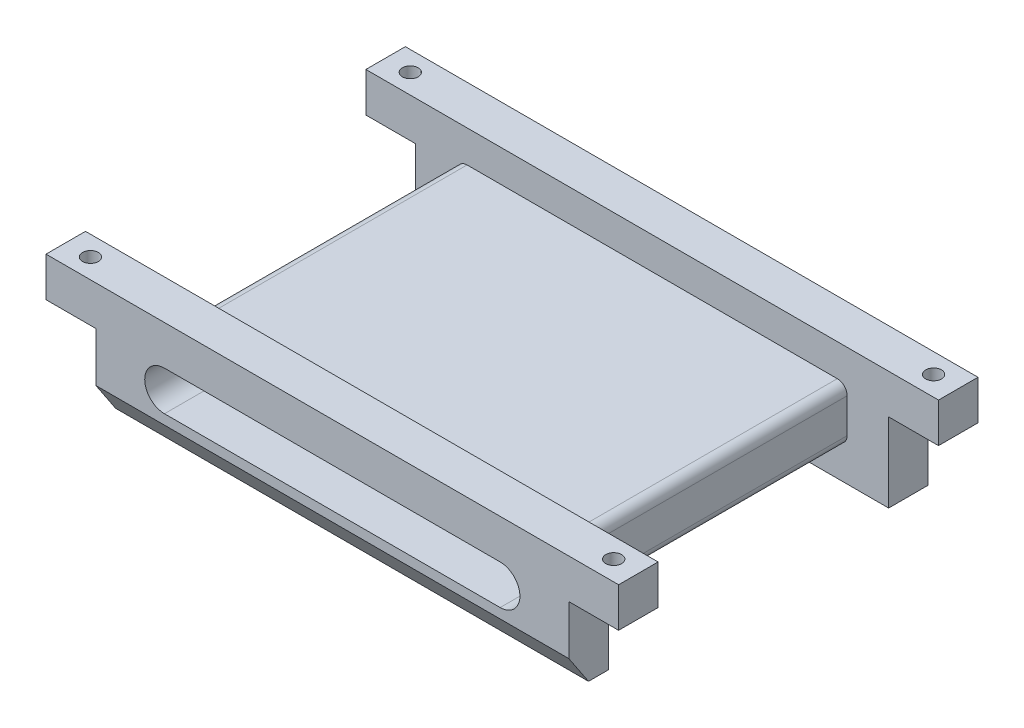
ISO-10303-21;
HEADER;
FILE_DESCRIPTION(('STEP AP214'),'2;1');
FILE_NAME('part.step','',(''),(''),'','','');
FILE_SCHEMA(('AUTOMOTIVE_DESIGN { 1 0 10303 214 1 1 1 1 }'));
ENDSEC;
DATA;
#1=APPLICATION_CONTEXT('core data for automotive mechanical design processes');
#2=APPLICATION_PROTOCOL_DEFINITION('international standard','automotive_design',2000,#1);
#3=PRODUCT_CONTEXT('',#1,'mechanical');
#4=PRODUCT('Part','Part','',(#3));
#5=PRODUCT_RELATED_PRODUCT_CATEGORY('part','',(#4));
#6=PRODUCT_DEFINITION_FORMATION('','',#4);
#7=PRODUCT_DEFINITION_CONTEXT('part definition',#1,'design');
#8=PRODUCT_DEFINITION('design','',#6,#7);
#9=PRODUCT_DEFINITION_SHAPE('','',#8);
#10=(LENGTH_UNIT() NAMED_UNIT(*) SI_UNIT(.MILLI.,.METRE.));
#11=(NAMED_UNIT(*) PLANE_ANGLE_UNIT() SI_UNIT($,.RADIAN.));
#12=(NAMED_UNIT(*) SI_UNIT($,.STERADIAN.) SOLID_ANGLE_UNIT());
#13=UNCERTAINTY_MEASURE_WITH_UNIT(LENGTH_MEASURE(1.E-05),#10,'distance_accuracy_value','');
#14=(GEOMETRIC_REPRESENTATION_CONTEXT(3) GLOBAL_UNCERTAINTY_ASSIGNED_CONTEXT((#13)) GLOBAL_UNIT_ASSIGNED_CONTEXT((#10,
#11,#12)) REPRESENTATION_CONTEXT('',''));
#15=CARTESIAN_POINT('',(0.,0.,0.));
#16=DIRECTION('',(0.,0.,1.));
#17=DIRECTION('',(1.,0.,0.));
#18=AXIS2_PLACEMENT_3D('',#15,#16,#17);
#19=CARTESIAN_POINT('',(0.,12.,36.4));
#20=DIRECTION('',(0.,-1.,0.));
#21=DIRECTION('',(0.,0.,-1.));
#22=AXIS2_PLACEMENT_3D('',#19,#20,#21);
#23=PLANE('',#22);
#24=CARTESIAN_POINT('',(2.5,12.,2.));
#25=DIRECTION('',(0.,1.,0.));
#26=DIRECTION('',(0.,0.,1.));
#27=AXIS2_PLACEMENT_3D('',#24,#25,#26);
#28=CIRCLE('',#27,0.799999999999988);
#29=CARTESIAN_POINT('',(2.5,12.,2.79999999999999));
#30=VERTEX_POINT('',#29);
#31=EDGE_CURVE('E837',#30,#30,#28,.T.);
#32=ORIENTED_EDGE('',*,*,#31,.F.);
#33=EDGE_LOOP('',(#32));
#34=FACE_BOUND('',#33,.T.);
#35=DIRECTION('',(0.,0.,-1.));
#36=VECTOR('',#35,1.);
#37=CARTESIAN_POINT('',(0.,12.,36.4));
#38=LINE('',#37,#36);
#39=CARTESIAN_POINT('',(0.,12.,4.));
#40=VERTEX_POINT('',#39);
#41=CARTESIAN_POINT('',(0.,12.,0.));
#42=VERTEX_POINT('',#41);
#43=EDGE_CURVE('E378',#40,#42,#38,.T.);
#44=ORIENTED_EDGE('',*,*,#43,.F.);
#45=DIRECTION('',(1.,0.,0.));
#46=VECTOR('',#45,1.);
#47=CARTESIAN_POINT('',(0.,12.,4.));
#48=LINE('',#47,#46);
#49=CARTESIAN_POINT('',(58.,12.,4.));
#50=VERTEX_POINT('',#49);
#51=EDGE_CURVE('E430',#40,#50,#48,.T.);
#52=ORIENTED_EDGE('',*,*,#51,.T.);
#53=DIRECTION('',(0.,0.,-1.));
#54=VECTOR('',#53,1.);
#55=CARTESIAN_POINT('',(58.,12.,36.4));
#56=LINE('',#55,#54);
#57=CARTESIAN_POINT('',(58.,12.,0.));
#58=VERTEX_POINT('',#57);
#59=EDGE_CURVE('E404',#50,#58,#56,.T.);
#60=ORIENTED_EDGE('',*,*,#59,.T.);
#61=DIRECTION('',(-1.,0.,0.));
#62=VECTOR('',#61,1.);
#63=CARTESIAN_POINT('',(0.,12.,0.));
#64=LINE('',#63,#62);
#65=EDGE_CURVE('E365',#58,#42,#64,.T.);
#66=ORIENTED_EDGE('',*,*,#65,.T.);
#67=EDGE_LOOP('',(#44,#52,#60,#66));
#68=FACE_BOUND('',#67,.T.);
#69=CARTESIAN_POINT('',(55.5,12.,2.));
#70=DIRECTION('',(0.,1.,0.));
#71=DIRECTION('',(0.,0.,1.));
#72=AXIS2_PLACEMENT_3D('',#69,#70,#71);
#73=CIRCLE('',#72,0.799999999999988);
#74=CARTESIAN_POINT('',(55.5,12.,2.79999999999999));
#75=VERTEX_POINT('',#74);
#76=EDGE_CURVE('E839',#75,#75,#73,.T.);
#77=ORIENTED_EDGE('',*,*,#76,.F.);
#78=EDGE_LOOP('',(#77));
#79=FACE_BOUND('',#78,.T.);
#80=ADVANCED_FACE('F35',(#34,#68,#79),#23,.F.);
#81=CARTESIAN_POINT('',(0.,8.,36.4));
#82=DIRECTION('',(1.,0.,0.));
#83=DIRECTION('',(0.,0.,-1.));
#84=AXIS2_PLACEMENT_3D('',#81,#82,#83);
#85=PLANE('',#84);
#86=CARTESIAN_POINT('',(0.,12.,36.4));
#87=VERTEX_POINT('',#86);
#88=CARTESIAN_POINT('',(0.,12.,32.4));
#89=VERTEX_POINT('',#88);
#90=EDGE_CURVE('E401',#87,#89,#38,.T.);
#91=ORIENTED_EDGE('',*,*,#90,.T.);
#92=DIRECTION('',(0.,-1.,0.));
#93=VECTOR('',#92,1.);
#94=CARTESIAN_POINT('',(0.,8.,32.4));
#95=LINE('',#94,#93);
#96=CARTESIAN_POINT('',(0.,8.,32.4));
#97=VERTEX_POINT('',#96);
#98=EDGE_CURVE('E326',#89,#97,#95,.T.);
#99=ORIENTED_EDGE('',*,*,#98,.T.);
#100=DIRECTION('',(0.,0.,-1.));
#101=VECTOR('',#100,1.);
#102=CARTESIAN_POINT('',(0.,8.,36.4));
#103=LINE('',#102,#101);
#104=CARTESIAN_POINT('',(0.,8.,36.4));
#105=VERTEX_POINT('',#104);
#106=EDGE_CURVE('E427',#105,#97,#103,.T.);
#107=ORIENTED_EDGE('',*,*,#106,.F.);
#108=DIRECTION('',(0.,-1.,0.));
#109=VECTOR('',#108,1.);
#110=CARTESIAN_POINT('',(0.,8.,36.4));
#111=LINE('',#110,#109);
#112=EDGE_CURVE('E361',#87,#105,#111,.T.);
#113=ORIENTED_EDGE('',*,*,#112,.F.);
#114=EDGE_LOOP('',(#91,#99,#107,#113));
#115=FACE_BOUND('',#114,.T.);
#116=ADVANCED_FACE('F464',(#115),#85,.F.);
#117=CARTESIAN_POINT('',(5.05,8.,36.4));
#118=DIRECTION('',(0.,1.,0.));
#119=DIRECTION('',(0.,0.,1.));
#120=AXIS2_PLACEMENT_3D('',#117,#118,#119);
#121=PLANE('',#120);
#122=CARTESIAN_POINT('',(2.5,8.,34.4));
#123=DIRECTION('',(0.,1.,0.));
#124=DIRECTION('',(0.,0.,1.));
#125=AXIS2_PLACEMENT_3D('',#122,#123,#124);
#126=CIRCLE('',#125,0.799999999999994);
#127=CARTESIAN_POINT('',(2.5,8.,35.2));
#128=VERTEX_POINT('',#127);
#129=EDGE_CURVE('E270',#128,#128,#126,.T.);
#130=ORIENTED_EDGE('',*,*,#129,.T.);
#131=EDGE_LOOP('',(#130));
#132=FACE_BOUND('',#131,.T.);
#133=ORIENTED_EDGE('',*,*,#106,.T.);
#134=DIRECTION('',(1.,0.,0.));
#135=VECTOR('',#134,1.);
#136=CARTESIAN_POINT('',(5.05,8.,32.4));
#137=LINE('',#136,#135);
#138=CARTESIAN_POINT('',(5.05,8.,32.4));
#139=VERTEX_POINT('',#138);
#140=EDGE_CURVE('E323',#97,#139,#137,.T.);
#141=ORIENTED_EDGE('',*,*,#140,.T.);
#142=DIRECTION('',(0.,0.,-1.));
#143=VECTOR('',#142,1.);
#144=CARTESIAN_POINT('',(5.05,8.,36.4));
#145=LINE('',#144,#143);
#146=CARTESIAN_POINT('',(5.05,8.,36.4));
#147=VERTEX_POINT('',#146);
#148=EDGE_CURVE('E423',#147,#139,#145,.T.);
#149=ORIENTED_EDGE('',*,*,#148,.F.);
#150=DIRECTION('',(1.,0.,0.));
#151=VECTOR('',#150,1.);
#152=CARTESIAN_POINT('',(5.05,8.,36.4));
#153=LINE('',#152,#151);
#154=EDGE_CURVE('E364',#105,#147,#153,.T.);
#155=ORIENTED_EDGE('',*,*,#154,.F.);
#156=EDGE_LOOP('',(#133,#141,#149,#155));
#157=FACE_BOUND('',#156,.T.);
#158=ADVANCED_FACE('F467',(#132,#157),#121,.F.);
#159=CARTESIAN_POINT('',(5.05,0.,36.4));
#160=DIRECTION('',(1.,0.,0.));
#161=DIRECTION('',(0.,1.,0.));
#162=AXIS2_PLACEMENT_3D('',#159,#160,#161);
#163=PLANE('',#162);
#164=DIRECTION('',(0.,0.,-1.));
#165=VECTOR('',#164,1.);
#166=CARTESIAN_POINT('',(5.05,0.,36.4));
#167=LINE('',#166,#165);
#168=CARTESIAN_POINT('',(5.05,0.,34.4));
#169=VERTEX_POINT('',#168);
#170=CARTESIAN_POINT('',(5.05,0.,32.4));
#171=VERTEX_POINT('',#170);
#172=EDGE_CURVE('E420',#169,#171,#167,.T.);
#173=ORIENTED_EDGE('',*,*,#172,.F.);
#174=DIRECTION('',(0.,-0.832050294337845,-0.554700196225228));
#175=VECTOR('',#174,1.);
#176=CARTESIAN_POINT('',(5.05,3.00000000000002,36.4));
#177=LINE('',#176,#175);
#178=CARTESIAN_POINT('',(5.05,3.00000000000002,36.4));
#179=VERTEX_POINT('',#178);
#180=EDGE_CURVE('E13',#169,#179,#177,.F.);
#181=ORIENTED_EDGE('',*,*,#180,.T.);
#182=DIRECTION('',(0.,-1.,0.));
#183=VECTOR('',#182,1.);
#184=CARTESIAN_POINT('',(5.05,0.,36.4));
#185=LINE('',#184,#183);
#186=EDGE_CURVE('E367',#147,#179,#185,.T.);
#187=ORIENTED_EDGE('',*,*,#186,.F.);
#188=ORIENTED_EDGE('',*,*,#148,.T.);
#189=DIRECTION('',(0.,-1.,0.));
#190=VECTOR('',#189,1.);
#191=CARTESIAN_POINT('',(5.05,0.,32.4));
#192=LINE('',#191,#190);
#193=EDGE_CURVE('E320',#139,#171,#192,.T.);
#194=ORIENTED_EDGE('',*,*,#193,.T.);
#195=EDGE_LOOP('',(#173,#181,#187,#188,#194));
#196=FACE_BOUND('',#195,.T.);
#197=ADVANCED_FACE('F469',(#196),#163,.F.);
#198=CARTESIAN_POINT('',(52.95,0.,36.4));
#199=DIRECTION('',(0.,1.,0.));
#200=DIRECTION('',(-1.,0.,0.));
#201=AXIS2_PLACEMENT_3D('',#198,#199,#200);
#202=PLANE('',#201);
#203=DIRECTION('',(0.,0.,-1.));
#204=VECTOR('',#203,1.);
#205=CARTESIAN_POINT('',(52.95,0.,36.4));
#206=LINE('',#205,#204);
#207=CARTESIAN_POINT('',(52.95,0.,34.4));
#208=VERTEX_POINT('',#207);
#209=CARTESIAN_POINT('',(52.95,0.,32.4));
#210=VERTEX_POINT('',#209);
#211=EDGE_CURVE('E417',#208,#210,#206,.T.);
#212=ORIENTED_EDGE('',*,*,#211,.F.);
#213=DIRECTION('',(-1.,0.,0.));
#214=VECTOR('',#213,1.);
#215=CARTESIAN_POINT('',(52.95,0.,34.4));
#216=LINE('',#215,#214);
#217=EDGE_CURVE('E43',#208,#169,#216,.T.);
#218=ORIENTED_EDGE('',*,*,#217,.T.);
#219=ORIENTED_EDGE('',*,*,#172,.T.);
#220=DIRECTION('',(1.,0.,0.));
#221=VECTOR('',#220,1.);
#222=CARTESIAN_POINT('',(52.95,0.,32.4));
#223=LINE('',#222,#221);
#224=EDGE_CURVE('E317',#171,#210,#223,.T.);
#225=ORIENTED_EDGE('',*,*,#224,.T.);
#226=EDGE_LOOP('',(#212,#218,#219,#225));
#227=FACE_BOUND('',#226,.T.);
#228=ADVANCED_FACE('F637',(#227),#202,.F.);
#229=CARTESIAN_POINT('',(52.95,8.,36.4));
#230=DIRECTION('',(-1.,0.,0.));
#231=DIRECTION('',(0.,0.,1.));
#232=AXIS2_PLACEMENT_3D('',#229,#230,#231);
#233=PLANE('',#232);
#234=DIRECTION('',(0.,1.,0.));
#235=VECTOR('',#234,1.);
#236=CARTESIAN_POINT('',(52.95,8.,36.4));
#237=LINE('',#236,#235);
#238=CARTESIAN_POINT('',(52.95,3.00000000000002,36.4));
#239=VERTEX_POINT('',#238);
#240=CARTESIAN_POINT('',(52.95,8.,36.4));
#241=VERTEX_POINT('',#240);
#242=EDGE_CURVE('E370',#239,#241,#237,.T.);
#243=ORIENTED_EDGE('',*,*,#242,.F.);
#244=DIRECTION('',(0.,0.832050294337845,0.554700196225228));
#245=VECTOR('',#244,1.);
#246=CARTESIAN_POINT('',(52.95,3.00000000000002,36.4));
#247=LINE('',#246,#245);
#248=EDGE_CURVE('E57',#239,#208,#247,.F.);
#249=ORIENTED_EDGE('',*,*,#248,.T.);
#250=ORIENTED_EDGE('',*,*,#211,.T.);
#251=DIRECTION('',(0.,1.,0.));
#252=VECTOR('',#251,1.);
#253=CARTESIAN_POINT('',(52.95,8.,32.4));
#254=LINE('',#253,#252);
#255=CARTESIAN_POINT('',(52.95,8.,32.4));
#256=VERTEX_POINT('',#255);
#257=EDGE_CURVE('E314',#210,#256,#254,.T.);
#258=ORIENTED_EDGE('',*,*,#257,.T.);
#259=DIRECTION('',(0.,0.,-1.));
#260=VECTOR('',#259,1.);
#261=CARTESIAN_POINT('',(52.95,8.,36.4));
#262=LINE('',#261,#260);
#263=EDGE_CURVE('E413',#241,#256,#262,.T.);
#264=ORIENTED_EDGE('',*,*,#263,.F.);
#265=EDGE_LOOP('',(#243,#249,#250,#258,#264));
#266=FACE_BOUND('',#265,.T.);
#267=ADVANCED_FACE('F447',(#266),#233,.F.);
#268=CARTESIAN_POINT('',(58.,8.,36.4));
#269=DIRECTION('',(0.,1.,0.));
#270=DIRECTION('',(0.,0.,1.));
#271=AXIS2_PLACEMENT_3D('',#268,#269,#270);
#272=PLANE('',#271);
#273=CARTESIAN_POINT('',(55.5,8.,34.4));
#274=DIRECTION('',(0.,1.,0.));
#275=DIRECTION('',(0.,0.,1.));
#276=AXIS2_PLACEMENT_3D('',#273,#274,#275);
#277=CIRCLE('',#276,0.799999999999995);
#278=CARTESIAN_POINT('',(55.5,8.,35.2));
#279=VERTEX_POINT('',#278);
#280=EDGE_CURVE('E509',#279,#279,#277,.T.);
#281=ORIENTED_EDGE('',*,*,#280,.T.);
#282=EDGE_LOOP('',(#281));
#283=FACE_BOUND('',#282,.T.);
#284=ORIENTED_EDGE('',*,*,#263,.T.);
#285=DIRECTION('',(1.,0.,0.));
#286=VECTOR('',#285,1.);
#287=CARTESIAN_POINT('',(58.,8.,32.4));
#288=LINE('',#287,#286);
#289=CARTESIAN_POINT('',(58.,8.,32.4));
#290=VERTEX_POINT('',#289);
#291=EDGE_CURVE('E311',#256,#290,#288,.T.);
#292=ORIENTED_EDGE('',*,*,#291,.T.);
#293=DIRECTION('',(0.,0.,-1.));
#294=VECTOR('',#293,1.);
#295=CARTESIAN_POINT('',(58.,8.,36.4));
#296=LINE('',#295,#294);
#297=CARTESIAN_POINT('',(58.,8.,36.4));
#298=VERTEX_POINT('',#297);
#299=EDGE_CURVE('E409',#298,#290,#296,.T.);
#300=ORIENTED_EDGE('',*,*,#299,.F.);
#301=DIRECTION('',(1.,0.,0.));
#302=VECTOR('',#301,1.);
#303=CARTESIAN_POINT('',(58.,8.,36.4));
#304=LINE('',#303,#302);
#305=EDGE_CURVE('E372',#241,#298,#304,.T.);
#306=ORIENTED_EDGE('',*,*,#305,.F.);
#307=EDGE_LOOP('',(#284,#292,#300,#306));
#308=FACE_BOUND('',#307,.T.);
#309=ADVANCED_FACE('F452',(#283,#308),#272,.F.);
#310=CARTESIAN_POINT('',(58.,12.,36.4));
#311=DIRECTION('',(-1.,0.,0.));
#312=DIRECTION('',(0.,0.,1.));
#313=AXIS2_PLACEMENT_3D('',#310,#311,#312);
#314=PLANE('',#313);
#315=ORIENTED_EDGE('',*,*,#299,.T.);
#316=DIRECTION('',(0.,1.,0.));
#317=VECTOR('',#316,1.);
#318=CARTESIAN_POINT('',(58.,12.,32.4));
#319=LINE('',#318,#317);
#320=CARTESIAN_POINT('',(58.,12.,32.4));
#321=VERTEX_POINT('',#320);
#322=EDGE_CURVE('E308',#290,#321,#319,.T.);
#323=ORIENTED_EDGE('',*,*,#322,.T.);
#324=CARTESIAN_POINT('',(58.,12.,36.4));
#325=VERTEX_POINT('',#324);
#326=EDGE_CURVE('E405',#325,#321,#56,.T.);
#327=ORIENTED_EDGE('',*,*,#326,.F.);
#328=DIRECTION('',(0.,1.,0.));
#329=VECTOR('',#328,1.);
#330=CARTESIAN_POINT('',(58.,12.,36.4));
#331=LINE('',#330,#329);
#332=EDGE_CURVE('E374',#298,#325,#331,.T.);
#333=ORIENTED_EDGE('',*,*,#332,.F.);
#334=EDGE_LOOP('',(#315,#323,#327,#333));
#335=FACE_BOUND('',#334,.T.);
#336=ADVANCED_FACE('F458',(#335),#314,.F.);
#337=CARTESIAN_POINT('',(55.5,12.,34.4));
#338=DIRECTION('',(0.,1.,0.));
#339=DIRECTION('',(0.,0.,1.));
#340=AXIS2_PLACEMENT_3D('',#337,#338,#339);
#341=CIRCLE('',#340,0.799999999999988);
#342=CARTESIAN_POINT('',(55.5,12.,35.2));
#343=VERTEX_POINT('',#342);
#344=EDGE_CURVE('E504',#343,#343,#341,.T.);
#345=ORIENTED_EDGE('',*,*,#344,.F.);
#346=EDGE_LOOP('',(#345));
#347=FACE_BOUND('',#346,.T.);
#348=CARTESIAN_POINT('',(2.5,12.,34.4));
#349=DIRECTION('',(0.,1.,0.));
#350=DIRECTION('',(0.,0.,1.));
#351=AXIS2_PLACEMENT_3D('',#348,#349,#350);
#352=CIRCLE('',#351,0.799999999999988);
#353=CARTESIAN_POINT('',(2.5,12.,35.2));
#354=VERTEX_POINT('',#353);
#355=EDGE_CURVE('E507',#354,#354,#352,.T.);
#356=ORIENTED_EDGE('',*,*,#355,.F.);
#357=EDGE_LOOP('',(#356));
#358=FACE_BOUND('',#357,.T.);
#359=ORIENTED_EDGE('',*,*,#326,.T.);
#360=DIRECTION('',(-1.,0.,0.));
#361=VECTOR('',#360,1.);
#362=CARTESIAN_POINT('',(0.,12.,32.4));
#363=LINE('',#362,#361);
#364=EDGE_CURVE('E433',#321,#89,#363,.T.);
#365=ORIENTED_EDGE('',*,*,#364,.T.);
#366=ORIENTED_EDGE('',*,*,#90,.F.);
#367=DIRECTION('',(-1.,0.,0.));
#368=VECTOR('',#367,1.);
#369=CARTESIAN_POINT('',(0.,12.,36.4));
#370=LINE('',#369,#368);
#371=EDGE_CURVE('E376',#325,#87,#370,.T.);
#372=ORIENTED_EDGE('',*,*,#371,.F.);
#373=EDGE_LOOP('',(#359,#365,#366,#372));
#374=FACE_BOUND('',#373,.T.);
#375=ADVANCED_FACE('F460',(#347,#358,#374),#23,.F.);
#376=CARTESIAN_POINT('',(0.,0.,36.4));
#377=DIRECTION('',(0.,0.,-1.));
#378=DIRECTION('',(-1.,0.,0.));
#379=AXIS2_PLACEMENT_3D('',#376,#377,#378);
#380=PLANE('',#379);
#381=ORIENTED_EDGE('',*,*,#186,.T.);
#382=DIRECTION('',(1.,0.,0.));
#383=VECTOR('',#382,1.);
#384=CARTESIAN_POINT('',(0.,3.00000000000002,36.4));
#385=LINE('',#384,#383);
#386=EDGE_CURVE('E436',#179,#239,#385,.T.);
#387=ORIENTED_EDGE('',*,*,#386,.T.);
#388=ORIENTED_EDGE('',*,*,#242,.T.);
#389=ORIENTED_EDGE('',*,*,#305,.T.);
#390=ORIENTED_EDGE('',*,*,#332,.T.);
#391=ORIENTED_EDGE('',*,*,#371,.T.);
#392=ORIENTED_EDGE('',*,*,#112,.T.);
#393=ORIENTED_EDGE('',*,*,#154,.T.);
#394=EDGE_LOOP('',(#381,#387,#388,#389,#390,#391,#392,#393));
#395=FACE_BOUND('',#394,.T.);
#396=CARTESIAN_POINT('',(12.,6.,36.4));
#397=DIRECTION('',(0.,0.,1.));
#398=DIRECTION('',(1.,0.,0.));
#399=AXIS2_PLACEMENT_3D('',#396,#397,#398);
#400=CIRCLE('',#399,2.);
#401=CARTESIAN_POINT('',(12.,8.,36.4));
#402=VERTEX_POINT('',#401);
#403=CARTESIAN_POINT('',(12.,4.,36.4));
#404=VERTEX_POINT('',#403);
#405=EDGE_CURVE('E330',#402,#404,#400,.T.);
#406=ORIENTED_EDGE('',*,*,#405,.F.);
#407=DIRECTION('',(-1.,0.,0.));
#408=VECTOR('',#407,1.);
#409=CARTESIAN_POINT('',(12.,8.,36.4));
#410=LINE('',#409,#408);
#411=CARTESIAN_POINT('',(46.,8.,36.4));
#412=VERTEX_POINT('',#411);
#413=EDGE_CURVE('E338',#412,#402,#410,.T.);
#414=ORIENTED_EDGE('',*,*,#413,.F.);
#415=CARTESIAN_POINT('',(46.,6.,36.4));
#416=DIRECTION('',(0.,0.,1.));
#417=DIRECTION('',(1.,0.,0.));
#418=AXIS2_PLACEMENT_3D('',#415,#416,#417);
#419=CIRCLE('',#418,2.);
#420=CARTESIAN_POINT('',(46.,4.,36.4));
#421=VERTEX_POINT('',#420);
#422=EDGE_CURVE('E335',#421,#412,#419,.T.);
#423=ORIENTED_EDGE('',*,*,#422,.F.);
#424=DIRECTION('',(1.,0.,0.));
#425=VECTOR('',#424,1.);
#426=CARTESIAN_POINT('',(12.,4.,36.4));
#427=LINE('',#426,#425);
#428=EDGE_CURVE('E332',#404,#421,#427,.T.);
#429=ORIENTED_EDGE('',*,*,#428,.F.);
#430=EDGE_LOOP('',(#406,#414,#423,#429));
#431=FACE_BOUND('',#430,.T.);
#432=ADVANCED_FACE('F441',(#395,#431),#380,.F.);
#433=CARTESIAN_POINT('',(0.,0.,0.));
#434=DIRECTION('',(0.,0.,-1.));
#435=DIRECTION('',(-1.,0.,0.));
#436=AXIS2_PLACEMENT_3D('',#433,#434,#435);
#437=PLANE('',#436);
#438=DIRECTION('',(0.,-1.,0.));
#439=VECTOR('',#438,1.);
#440=CARTESIAN_POINT('',(0.,8.,0.));
#441=LINE('',#440,#439);
#442=CARTESIAN_POINT('',(0.,8.,0.));
#443=VERTEX_POINT('',#442);
#444=EDGE_CURVE('E360',#42,#443,#441,.T.);
#445=ORIENTED_EDGE('',*,*,#444,.F.);
#446=ORIENTED_EDGE('',*,*,#65,.F.);
#447=DIRECTION('',(0.,1.,0.));
#448=VECTOR('',#447,1.);
#449=CARTESIAN_POINT('',(58.,12.,0.));
#450=LINE('',#449,#448);
#451=CARTESIAN_POINT('',(58.,8.,0.));
#452=VERTEX_POINT('',#451);
#453=EDGE_CURVE('E396',#452,#58,#450,.T.);
#454=ORIENTED_EDGE('',*,*,#453,.F.);
#455=DIRECTION('',(1.,0.,0.));
#456=VECTOR('',#455,1.);
#457=CARTESIAN_POINT('',(58.,8.,0.));
#458=LINE('',#457,#456);
#459=CARTESIAN_POINT('',(52.95,8.,0.));
#460=VERTEX_POINT('',#459);
#461=EDGE_CURVE('E393',#460,#452,#458,.T.);
#462=ORIENTED_EDGE('',*,*,#461,.F.);
#463=DIRECTION('',(0.,1.,0.));
#464=VECTOR('',#463,1.);
#465=CARTESIAN_POINT('',(52.95,8.,0.));
#466=LINE('',#465,#464);
#467=CARTESIAN_POINT('',(52.95,0.,0.));
#468=VERTEX_POINT('',#467);
#469=EDGE_CURVE('E390',#468,#460,#466,.T.);
#470=ORIENTED_EDGE('',*,*,#469,.F.);
#471=DIRECTION('',(1.,0.,0.));
#472=VECTOR('',#471,1.);
#473=CARTESIAN_POINT('',(52.95,0.,0.));
#474=LINE('',#473,#472);
#475=CARTESIAN_POINT('',(5.05,0.,0.));
#476=VERTEX_POINT('',#475);
#477=EDGE_CURVE('E387',#476,#468,#474,.T.);
#478=ORIENTED_EDGE('',*,*,#477,.F.);
#479=DIRECTION('',(0.,-1.,0.));
#480=VECTOR('',#479,1.);
#481=CARTESIAN_POINT('',(5.05,0.,0.));
#482=LINE('',#481,#480);
#483=CARTESIAN_POINT('',(5.05,8.,0.));
#484=VERTEX_POINT('',#483);
#485=EDGE_CURVE('E384',#484,#476,#482,.T.);
#486=ORIENTED_EDGE('',*,*,#485,.F.);
#487=DIRECTION('',(1.,0.,0.));
#488=VECTOR('',#487,1.);
#489=CARTESIAN_POINT('',(5.05,8.,0.));
#490=LINE('',#489,#488);
#491=EDGE_CURVE('E381',#443,#484,#490,.T.);
#492=ORIENTED_EDGE('',*,*,#491,.F.);
#493=EDGE_LOOP('',(#445,#446,#454,#462,#470,#478,#486,#492));
#494=FACE_BOUND('',#493,.T.);
#495=DIRECTION('',(-1.,0.,0.));
#496=VECTOR('',#495,1.);
#497=CARTESIAN_POINT('',(12.,8.,0.));
#498=LINE('',#497,#496);
#499=CARTESIAN_POINT('',(46.,8.,0.));
#500=VERTEX_POINT('',#499);
#501=CARTESIAN_POINT('',(12.,8.,0.));
#502=VERTEX_POINT('',#501);
#503=EDGE_CURVE('E333',#500,#502,#498,.T.);
#504=ORIENTED_EDGE('',*,*,#503,.T.);
#505=CARTESIAN_POINT('',(12.,6.,0.));
#506=DIRECTION('',(0.,0.,1.));
#507=DIRECTION('',(1.,0.,0.));
#508=AXIS2_PLACEMENT_3D('',#505,#506,#507);
#509=CIRCLE('',#508,2.);
#510=CARTESIAN_POINT('',(12.,4.,0.));
#511=VERTEX_POINT('',#510);
#512=EDGE_CURVE('E329',#502,#511,#509,.T.);
#513=ORIENTED_EDGE('',*,*,#512,.T.);
#514=DIRECTION('',(1.,0.,0.));
#515=VECTOR('',#514,1.);
#516=CARTESIAN_POINT('',(12.,4.,0.));
#517=LINE('',#516,#515);
#518=CARTESIAN_POINT('',(46.,4.,0.));
#519=VERTEX_POINT('',#518);
#520=EDGE_CURVE('E343',#511,#519,#517,.T.);
#521=ORIENTED_EDGE('',*,*,#520,.T.);
#522=CARTESIAN_POINT('',(46.,6.,0.));
#523=DIRECTION('',(0.,0.,1.));
#524=DIRECTION('',(1.,0.,0.));
#525=AXIS2_PLACEMENT_3D('',#522,#523,#524);
#526=CIRCLE('',#525,2.);
#527=EDGE_CURVE('E346',#519,#500,#526,.T.);
#528=ORIENTED_EDGE('',*,*,#527,.T.);
#529=EDGE_LOOP('',(#504,#513,#521,#528));
#530=FACE_BOUND('',#529,.T.);
#531=ADVANCED_FACE('F498',(#494,#530),#437,.T.);
#532=CARTESIAN_POINT('',(0.,8.,4.));
#533=VERTEX_POINT('',#532);
#534=EDGE_CURVE('E426',#533,#443,#103,.T.);
#535=ORIENTED_EDGE('',*,*,#534,.F.);
#536=DIRECTION('',(0.,1.,0.));
#537=VECTOR('',#536,1.);
#538=CARTESIAN_POINT('',(0.,8.,4.));
#539=LINE('',#538,#537);
#540=EDGE_CURVE('E305',#533,#40,#539,.T.);
#541=ORIENTED_EDGE('',*,*,#540,.T.);
#542=ORIENTED_EDGE('',*,*,#43,.T.);
#543=ORIENTED_EDGE('',*,*,#444,.T.);
#544=EDGE_LOOP('',(#535,#541,#542,#543));
#545=FACE_BOUND('',#544,.T.);
#546=ADVANCED_FACE('F487',(#545),#85,.F.);
#547=CARTESIAN_POINT('',(2.5,8.,2.));
#548=DIRECTION('',(0.,1.,0.));
#549=DIRECTION('',(0.,0.,1.));
#550=AXIS2_PLACEMENT_3D('',#547,#548,#549);
#551=CIRCLE('',#550,0.799999999999994);
#552=CARTESIAN_POINT('',(2.5,8.,2.8));
#553=VERTEX_POINT('',#552);
#554=EDGE_CURVE('E835',#553,#553,#551,.T.);
#555=ORIENTED_EDGE('',*,*,#554,.T.);
#556=EDGE_LOOP('',(#555));
#557=FACE_BOUND('',#556,.T.);
#558=CARTESIAN_POINT('',(5.05,8.,4.));
#559=VERTEX_POINT('',#558);
#560=EDGE_CURVE('E422',#559,#484,#145,.T.);
#561=ORIENTED_EDGE('',*,*,#560,.F.);
#562=DIRECTION('',(-1.,0.,0.));
#563=VECTOR('',#562,1.);
#564=CARTESIAN_POINT('',(5.05,8.,4.));
#565=LINE('',#564,#563);
#566=EDGE_CURVE('E302',#559,#533,#565,.T.);
#567=ORIENTED_EDGE('',*,*,#566,.T.);
#568=ORIENTED_EDGE('',*,*,#534,.T.);
#569=ORIENTED_EDGE('',*,*,#491,.T.);
#570=EDGE_LOOP('',(#561,#567,#568,#569));
#571=FACE_BOUND('',#570,.T.);
#572=ADVANCED_FACE('F585',(#557,#571),#121,.F.);
#573=CARTESIAN_POINT('',(5.05,0.,4.));
#574=VERTEX_POINT('',#573);
#575=EDGE_CURVE('E419',#574,#476,#167,.T.);
#576=ORIENTED_EDGE('',*,*,#575,.F.);
#577=DIRECTION('',(0.,1.,0.));
#578=VECTOR('',#577,1.);
#579=CARTESIAN_POINT('',(5.05,0.,4.));
#580=LINE('',#579,#578);
#581=EDGE_CURVE('E299',#574,#559,#580,.T.);
#582=ORIENTED_EDGE('',*,*,#581,.T.);
#583=ORIENTED_EDGE('',*,*,#560,.T.);
#584=ORIENTED_EDGE('',*,*,#485,.T.);
#585=EDGE_LOOP('',(#576,#582,#583,#584));
#586=FACE_BOUND('',#585,.T.);
#587=ADVANCED_FACE('F621',(#586),#163,.F.);
#588=CARTESIAN_POINT('',(52.95,0.,4.));
#589=VERTEX_POINT('',#588);
#590=EDGE_CURVE('E416',#589,#468,#206,.T.);
#591=ORIENTED_EDGE('',*,*,#590,.F.);
#592=DIRECTION('',(-1.,0.,0.));
#593=VECTOR('',#592,1.);
#594=CARTESIAN_POINT('',(52.95,0.,4.));
#595=LINE('',#594,#593);
#596=EDGE_CURVE('E296',#589,#574,#595,.T.);
#597=ORIENTED_EDGE('',*,*,#596,.T.);
#598=ORIENTED_EDGE('',*,*,#575,.T.);
#599=ORIENTED_EDGE('',*,*,#477,.T.);
#600=EDGE_LOOP('',(#591,#597,#598,#599));
#601=FACE_BOUND('',#600,.T.);
#602=ADVANCED_FACE('F618',(#601),#202,.F.);
#603=CARTESIAN_POINT('',(52.95,8.,4.));
#604=VERTEX_POINT('',#603);
#605=EDGE_CURVE('E412',#604,#460,#262,.T.);
#606=ORIENTED_EDGE('',*,*,#605,.F.);
#607=DIRECTION('',(0.,-1.,0.));
#608=VECTOR('',#607,1.);
#609=CARTESIAN_POINT('',(52.95,8.,4.));
#610=LINE('',#609,#608);
#611=EDGE_CURVE('E293',#604,#589,#610,.T.);
#612=ORIENTED_EDGE('',*,*,#611,.T.);
#613=ORIENTED_EDGE('',*,*,#590,.T.);
#614=ORIENTED_EDGE('',*,*,#469,.T.);
#615=EDGE_LOOP('',(#606,#612,#613,#614));
#616=FACE_BOUND('',#615,.T.);
#617=ADVANCED_FACE('F615',(#616),#233,.F.);
#618=CARTESIAN_POINT('',(55.5,8.,2.));
#619=DIRECTION('',(0.,1.,0.));
#620=DIRECTION('',(0.,0.,1.));
#621=AXIS2_PLACEMENT_3D('',#618,#619,#620);
#622=CIRCLE('',#621,0.799999999999995);
#623=CARTESIAN_POINT('',(55.5,8.,2.8));
#624=VERTEX_POINT('',#623);
#625=EDGE_CURVE('E844',#624,#624,#622,.T.);
#626=ORIENTED_EDGE('',*,*,#625,.T.);
#627=EDGE_LOOP('',(#626));
#628=FACE_BOUND('',#627,.T.);
#629=CARTESIAN_POINT('',(58.,8.,4.));
#630=VERTEX_POINT('',#629);
#631=EDGE_CURVE('E408',#630,#452,#296,.T.);
#632=ORIENTED_EDGE('',*,*,#631,.F.);
#633=DIRECTION('',(-1.,0.,0.));
#634=VECTOR('',#633,1.);
#635=CARTESIAN_POINT('',(58.,8.,4.));
#636=LINE('',#635,#634);
#637=EDGE_CURVE('E290',#630,#604,#636,.T.);
#638=ORIENTED_EDGE('',*,*,#637,.T.);
#639=ORIENTED_EDGE('',*,*,#605,.T.);
#640=ORIENTED_EDGE('',*,*,#461,.T.);
#641=EDGE_LOOP('',(#632,#638,#639,#640));
#642=FACE_BOUND('',#641,.T.);
#643=ADVANCED_FACE('F612',(#628,#642),#272,.F.);
#644=ORIENTED_EDGE('',*,*,#59,.F.);
#645=DIRECTION('',(0.,-1.,0.));
#646=VECTOR('',#645,1.);
#647=CARTESIAN_POINT('',(58.,12.,4.));
#648=LINE('',#647,#646);
#649=EDGE_CURVE('E258',#50,#630,#648,.T.);
#650=ORIENTED_EDGE('',*,*,#649,.T.);
#651=ORIENTED_EDGE('',*,*,#631,.T.);
#652=ORIENTED_EDGE('',*,*,#453,.T.);
#653=EDGE_LOOP('',(#644,#650,#651,#652));
#654=FACE_BOUND('',#653,.T.);
#655=ADVANCED_FACE('F500',(#654),#314,.F.);
#656=CARTESIAN_POINT('',(12.,6.,36.4));
#657=DIRECTION('',(0.,0.,-1.));
#658=DIRECTION('',(-1.,0.,0.));
#659=AXIS2_PLACEMENT_3D('',#656,#657,#658);
#660=CYLINDRICAL_SURFACE('',#659,2.);
#661=ORIENTED_EDGE('',*,*,#512,.F.);
#662=DIRECTION('',(0.,0.,-1.));
#663=VECTOR('',#662,1.);
#664=CARTESIAN_POINT('',(12.,8.,36.4));
#665=LINE('',#664,#663);
#666=EDGE_CURVE('E340',#402,#502,#665,.T.);
#667=ORIENTED_EDGE('',*,*,#666,.F.);
#668=ORIENTED_EDGE('',*,*,#405,.T.);
#669=DIRECTION('',(0.,0.,-1.));
#670=VECTOR('',#669,1.);
#671=CARTESIAN_POINT('',(12.,4.,36.4));
#672=LINE('',#671,#670);
#673=EDGE_CURVE('E357',#404,#511,#672,.T.);
#674=ORIENTED_EDGE('',*,*,#673,.T.);
#675=EDGE_LOOP('',(#661,#667,#668,#674));
#676=FACE_BOUND('',#675,.T.);
#677=ADVANCED_FACE('F576',(#676),#660,.F.);
#678=CARTESIAN_POINT('',(12.,4.,36.4));
#679=DIRECTION('',(0.,1.,0.));
#680=DIRECTION('',(0.,0.,1.));
#681=AXIS2_PLACEMENT_3D('',#678,#679,#680);
#682=PLANE('',#681);
#683=ORIENTED_EDGE('',*,*,#520,.F.);
#684=ORIENTED_EDGE('',*,*,#673,.F.);
#685=ORIENTED_EDGE('',*,*,#428,.T.);
#686=DIRECTION('',(0.,0.,-1.));
#687=VECTOR('',#686,1.);
#688=CARTESIAN_POINT('',(46.,4.,36.4));
#689=LINE('',#688,#687);
#690=EDGE_CURVE('E355',#421,#519,#689,.T.);
#691=ORIENTED_EDGE('',*,*,#690,.T.);
#692=EDGE_LOOP('',(#683,#684,#685,#691));
#693=FACE_BOUND('',#692,.T.);
#694=ADVANCED_FACE('F572',(#693),#682,.T.);
#695=CARTESIAN_POINT('',(46.,6.,36.4));
#696=DIRECTION('',(0.,0.,-1.));
#697=DIRECTION('',(-1.,0.,0.));
#698=AXIS2_PLACEMENT_3D('',#695,#696,#697);
#699=CYLINDRICAL_SURFACE('',#698,2.);
#700=ORIENTED_EDGE('',*,*,#527,.F.);
#701=ORIENTED_EDGE('',*,*,#690,.F.);
#702=ORIENTED_EDGE('',*,*,#422,.T.);
#703=DIRECTION('',(0.,0.,-1.));
#704=VECTOR('',#703,1.);
#705=CARTESIAN_POINT('',(46.,8.,36.4));
#706=LINE('',#705,#704);
#707=EDGE_CURVE('E353',#412,#500,#706,.T.);
#708=ORIENTED_EDGE('',*,*,#707,.T.);
#709=EDGE_LOOP('',(#700,#701,#702,#708));
#710=FACE_BOUND('',#709,.T.);
#711=ADVANCED_FACE('F568',(#710),#699,.F.);
#712=CARTESIAN_POINT('',(12.,8.,36.4));
#713=DIRECTION('',(0.,-1.,0.));
#714=DIRECTION('',(0.,0.,-1.));
#715=AXIS2_PLACEMENT_3D('',#712,#713,#714);
#716=PLANE('',#715);
#717=ORIENTED_EDGE('',*,*,#503,.F.);
#718=ORIENTED_EDGE('',*,*,#707,.F.);
#719=ORIENTED_EDGE('',*,*,#413,.T.);
#720=ORIENTED_EDGE('',*,*,#666,.T.);
#721=EDGE_LOOP('',(#717,#718,#719,#720));
#722=FACE_BOUND('',#721,.T.);
#723=ADVANCED_FACE('F565',(#722),#716,.T.);
#724=CARTESIAN_POINT('',(29.,6.,32.4));
#725=DIRECTION('',(0.,0.,1.));
#726=DIRECTION('',(1.,0.,0.));
#727=AXIS2_PLACEMENT_3D('',#724,#725,#726);
#728=PLANE('',#727);
#729=CARTESIAN_POINT('',(10.25,4.25,32.4));
#730=DIRECTION('',(0.,0.,1.));
#731=DIRECTION('',(1.,0.,0.));
#732=AXIS2_PLACEMENT_3D('',#729,#730,#731);
#733=CIRCLE('',#732,1.);
#734=CARTESIAN_POINT('',(9.25,4.25,32.4));
#735=VERTEX_POINT('',#734);
#736=CARTESIAN_POINT('',(10.25,3.25,32.4));
#737=VERTEX_POINT('',#736);
#738=EDGE_CURVE('E252',#735,#737,#733,.T.);
#739=ORIENTED_EDGE('',*,*,#738,.T.);
#740=DIRECTION('',(1.,0.,0.));
#741=VECTOR('',#740,1.);
#742=CARTESIAN_POINT('',(10.25,3.25,32.4));
#743=LINE('',#742,#741);
#744=CARTESIAN_POINT('',(47.75,3.25,32.4));
#745=VERTEX_POINT('',#744);
#746=EDGE_CURVE('E229',#737,#745,#743,.T.);
#747=ORIENTED_EDGE('',*,*,#746,.T.);
#748=CARTESIAN_POINT('',(47.75,4.25,32.4));
#749=DIRECTION('',(0.,0.,1.));
#750=DIRECTION('',(1.,0.,0.));
#751=AXIS2_PLACEMENT_3D('',#748,#749,#750);
#752=CIRCLE('',#751,1.);
#753=CARTESIAN_POINT('',(48.75,4.25,32.4));
#754=VERTEX_POINT('',#753);
#755=EDGE_CURVE('E234',#745,#754,#752,.T.);
#756=ORIENTED_EDGE('',*,*,#755,.T.);
#757=DIRECTION('',(0.,1.,0.));
#758=VECTOR('',#757,1.);
#759=CARTESIAN_POINT('',(48.75,7.75,32.4));
#760=LINE('',#759,#758);
#761=CARTESIAN_POINT('',(48.75,7.75,32.4));
#762=VERTEX_POINT('',#761);
#763=EDGE_CURVE('E285',#754,#762,#760,.T.);
#764=ORIENTED_EDGE('',*,*,#763,.T.);
#765=CARTESIAN_POINT('',(47.75,7.75,32.4));
#766=DIRECTION('',(0.,0.,1.));
#767=DIRECTION('',(-1.,0.,0.));
#768=AXIS2_PLACEMENT_3D('',#765,#766,#767);
#769=CIRCLE('',#768,1.);
#770=CARTESIAN_POINT('',(47.75,8.75,32.4));
#771=VERTEX_POINT('',#770);
#772=EDGE_CURVE('E282',#762,#771,#769,.T.);
#773=ORIENTED_EDGE('',*,*,#772,.T.);
#774=DIRECTION('',(-1.,0.,0.));
#775=VECTOR('',#774,1.);
#776=CARTESIAN_POINT('',(10.25,8.75,32.4));
#777=LINE('',#776,#775);
#778=CARTESIAN_POINT('',(10.25,8.75,32.4));
#779=VERTEX_POINT('',#778);
#780=EDGE_CURVE('E279',#771,#779,#777,.T.);
#781=ORIENTED_EDGE('',*,*,#780,.T.);
#782=CARTESIAN_POINT('',(10.25,7.75,32.4));
#783=DIRECTION('',(0.,0.,1.));
#784=DIRECTION('',(1.,0.,0.));
#785=AXIS2_PLACEMENT_3D('',#782,#783,#784);
#786=CIRCLE('',#785,1.);
#787=CARTESIAN_POINT('',(9.25,7.75,32.4));
#788=VERTEX_POINT('',#787);
#789=EDGE_CURVE('E276',#779,#788,#786,.T.);
#790=ORIENTED_EDGE('',*,*,#789,.T.);
#791=DIRECTION('',(0.,-1.,0.));
#792=VECTOR('',#791,1.);
#793=CARTESIAN_POINT('',(9.25,7.75,32.4));
#794=LINE('',#793,#792);
#795=EDGE_CURVE('E273',#788,#735,#794,.T.);
#796=ORIENTED_EDGE('',*,*,#795,.T.);
#797=EDGE_LOOP('',(#739,#747,#756,#764,#773,#781,#790,#796));
#798=FACE_BOUND('',#797,.T.);
#799=ORIENTED_EDGE('',*,*,#364,.F.);
#800=ORIENTED_EDGE('',*,*,#322,.F.);
#801=ORIENTED_EDGE('',*,*,#291,.F.);
#802=ORIENTED_EDGE('',*,*,#257,.F.);
#803=ORIENTED_EDGE('',*,*,#224,.F.);
#804=ORIENTED_EDGE('',*,*,#193,.F.);
#805=ORIENTED_EDGE('',*,*,#140,.F.);
#806=ORIENTED_EDGE('',*,*,#98,.F.);
#807=EDGE_LOOP('',(#799,#800,#801,#802,#803,#804,#805,#806));
#808=FACE_BOUND('',#807,.T.);
#809=ADVANCED_FACE('F530',(#798,#808),#728,.F.);
#810=CARTESIAN_POINT('',(0.,0.,4.));
#811=DIRECTION('',(0.,0.,-1.));
#812=DIRECTION('',(-1.,0.,0.));
#813=AXIS2_PLACEMENT_3D('',#810,#811,#812);
#814=PLANE('',#813);
#815=DIRECTION('',(0.,-1.,0.));
#816=VECTOR('',#815,1.);
#817=CARTESIAN_POINT('',(9.25,7.75,4.));
#818=LINE('',#817,#816);
#819=CARTESIAN_POINT('',(9.25,7.75,4.));
#820=VERTEX_POINT('',#819);
#821=CARTESIAN_POINT('',(9.25,4.25,4.));
#822=VERTEX_POINT('',#821);
#823=EDGE_CURVE('E248',#820,#822,#818,.T.);
#824=ORIENTED_EDGE('',*,*,#823,.F.);
#825=CARTESIAN_POINT('',(10.25,7.75,4.));
#826=DIRECTION('',(0.,0.,-1.));
#827=DIRECTION('',(-1.,0.,0.));
#828=AXIS2_PLACEMENT_3D('',#825,#826,#827);
#829=CIRCLE('',#828,1.);
#830=CARTESIAN_POINT('',(10.25,8.75,4.));
#831=VERTEX_POINT('',#830);
#832=EDGE_CURVE('E255',#831,#820,#829,.F.);
#833=ORIENTED_EDGE('',*,*,#832,.F.);
#834=DIRECTION('',(-1.,0.,0.));
#835=VECTOR('',#834,1.);
#836=CARTESIAN_POINT('',(10.25,8.75,4.));
#837=LINE('',#836,#835);
#838=CARTESIAN_POINT('',(47.75,8.75,4.));
#839=VERTEX_POINT('',#838);
#840=EDGE_CURVE('E259',#839,#831,#837,.T.);
#841=ORIENTED_EDGE('',*,*,#840,.F.);
#842=CARTESIAN_POINT('',(47.75,7.75,4.));
#843=DIRECTION('',(0.,0.,-1.));
#844=DIRECTION('',(-1.,0.,0.));
#845=AXIS2_PLACEMENT_3D('',#842,#843,#844);
#846=CIRCLE('',#845,1.);
#847=CARTESIAN_POINT('',(48.75,7.75,4.));
#848=VERTEX_POINT('',#847);
#849=EDGE_CURVE('E262',#848,#839,#846,.F.);
#850=ORIENTED_EDGE('',*,*,#849,.F.);
#851=DIRECTION('',(0.,1.,0.));
#852=VECTOR('',#851,1.);
#853=CARTESIAN_POINT('',(48.75,7.75,4.));
#854=LINE('',#853,#852);
#855=CARTESIAN_POINT('',(48.75,4.25,4.));
#856=VERTEX_POINT('',#855);
#857=EDGE_CURVE('E265',#856,#848,#854,.T.);
#858=ORIENTED_EDGE('',*,*,#857,.F.);
#859=CARTESIAN_POINT('',(47.75,4.25,4.));
#860=DIRECTION('',(0.,0.,-1.));
#861=DIRECTION('',(-1.,0.,0.));
#862=AXIS2_PLACEMENT_3D('',#859,#860,#861);
#863=CIRCLE('',#862,1.);
#864=CARTESIAN_POINT('',(47.75,3.25,4.));
#865=VERTEX_POINT('',#864);
#866=EDGE_CURVE('E243',#865,#856,#863,.F.);
#867=ORIENTED_EDGE('',*,*,#866,.F.);
#868=DIRECTION('',(1.,0.,0.));
#869=VECTOR('',#868,1.);
#870=CARTESIAN_POINT('',(10.25,3.25,4.));
#871=LINE('',#870,#869);
#872=CARTESIAN_POINT('',(10.25,3.25,4.));
#873=VERTEX_POINT('',#872);
#874=EDGE_CURVE('E227',#873,#865,#871,.T.);
#875=ORIENTED_EDGE('',*,*,#874,.F.);
#876=CARTESIAN_POINT('',(10.25,4.25,4.));
#877=DIRECTION('',(0.,0.,-1.));
#878=DIRECTION('',(-1.,0.,0.));
#879=AXIS2_PLACEMENT_3D('',#876,#877,#878);
#880=CIRCLE('',#879,1.);
#881=EDGE_CURVE('E240',#822,#873,#880,.F.);
#882=ORIENTED_EDGE('',*,*,#881,.F.);
#883=EDGE_LOOP('',(#824,#833,#841,#850,#858,#867,#875,#882));
#884=FACE_BOUND('',#883,.T.);
#885=ORIENTED_EDGE('',*,*,#566,.F.);
#886=ORIENTED_EDGE('',*,*,#581,.F.);
#887=ORIENTED_EDGE('',*,*,#596,.F.);
#888=ORIENTED_EDGE('',*,*,#611,.F.);
#889=ORIENTED_EDGE('',*,*,#637,.F.);
#890=ORIENTED_EDGE('',*,*,#649,.F.);
#891=ORIENTED_EDGE('',*,*,#51,.F.);
#892=ORIENTED_EDGE('',*,*,#540,.F.);
#893=EDGE_LOOP('',(#885,#886,#887,#888,#889,#890,#891,#892));
#894=FACE_BOUND('',#893,.T.);
#895=ADVANCED_FACE('F238',(#884,#894),#814,.F.);
#896=CARTESIAN_POINT('',(10.25,4.25,-61.3456034968262));
#897=DIRECTION('',(0.,0.,1.));
#898=DIRECTION('',(1.,0.,0.));
#899=AXIS2_PLACEMENT_3D('',#896,#897,#898);
#900=CYLINDRICAL_SURFACE('',#899,1.);
#901=ORIENTED_EDGE('',*,*,#881,.T.);
#902=DIRECTION('',(0.,0.,1.));
#903=VECTOR('',#902,1.);
#904=CARTESIAN_POINT('',(10.25,3.25,-61.3456034968262));
#905=LINE('',#904,#903);
#906=EDGE_CURVE('E224',#873,#737,#905,.T.);
#907=ORIENTED_EDGE('',*,*,#906,.T.);
#908=ORIENTED_EDGE('',*,*,#738,.F.);
#909=DIRECTION('',(0.,0.,1.));
#910=VECTOR('',#909,1.);
#911=CARTESIAN_POINT('',(9.25,4.25,-61.3456034968262));
#912=LINE('',#911,#910);
#913=EDGE_CURVE('E246',#822,#735,#912,.T.);
#914=ORIENTED_EDGE('',*,*,#913,.F.);
#915=EDGE_LOOP('',(#901,#907,#908,#914));
#916=FACE_BOUND('',#915,.T.);
#917=ADVANCED_FACE('F245',(#916),#900,.T.);
#918=CARTESIAN_POINT('',(9.25,7.75,-61.3456034968262));
#919=DIRECTION('',(-1.,0.,0.));
#920=DIRECTION('',(0.,-1.,0.));
#921=AXIS2_PLACEMENT_3D('',#918,#919,#920);
#922=PLANE('',#921);
#923=ORIENTED_EDGE('',*,*,#823,.T.);
#924=ORIENTED_EDGE('',*,*,#913,.T.);
#925=ORIENTED_EDGE('',*,*,#795,.F.);
#926=DIRECTION('',(0.,0.,1.));
#927=VECTOR('',#926,1.);
#928=CARTESIAN_POINT('',(9.25,7.75,-61.3456034968262));
#929=LINE('',#928,#927);
#930=EDGE_CURVE('E271',#820,#788,#929,.T.);
#931=ORIENTED_EDGE('',*,*,#930,.F.);
#932=EDGE_LOOP('',(#923,#924,#925,#931));
#933=FACE_BOUND('',#932,.T.);
#934=ADVANCED_FACE('F552',(#933),#922,.T.);
#935=CARTESIAN_POINT('',(10.25,7.75,-61.3456034968262));
#936=DIRECTION('',(0.,0.,1.));
#937=DIRECTION('',(1.,0.,0.));
#938=AXIS2_PLACEMENT_3D('',#935,#936,#937);
#939=CYLINDRICAL_SURFACE('',#938,1.);
#940=ORIENTED_EDGE('',*,*,#832,.T.);
#941=ORIENTED_EDGE('',*,*,#930,.T.);
#942=ORIENTED_EDGE('',*,*,#789,.F.);
#943=DIRECTION('',(0.,0.,1.));
#944=VECTOR('',#943,1.);
#945=CARTESIAN_POINT('',(10.25,8.75,-61.3456034968262));
#946=LINE('',#945,#944);
#947=EDGE_CURVE('E274',#831,#779,#946,.T.);
#948=ORIENTED_EDGE('',*,*,#947,.F.);
#949=EDGE_LOOP('',(#940,#941,#942,#948));
#950=FACE_BOUND('',#949,.T.);
#951=ADVANCED_FACE('F549',(#950),#939,.T.);
#952=CARTESIAN_POINT('',(10.25,8.75,-61.3456034968262));
#953=DIRECTION('',(0.,1.,0.));
#954=DIRECTION('',(0.,0.,1.));
#955=AXIS2_PLACEMENT_3D('',#952,#953,#954);
#956=PLANE('',#955);
#957=ORIENTED_EDGE('',*,*,#840,.T.);
#958=ORIENTED_EDGE('',*,*,#947,.T.);
#959=ORIENTED_EDGE('',*,*,#780,.F.);
#960=DIRECTION('',(0.,0.,1.));
#961=VECTOR('',#960,1.);
#962=CARTESIAN_POINT('',(47.75,8.75,-61.3456034968262));
#963=LINE('',#962,#961);
#964=EDGE_CURVE('E277',#839,#771,#963,.T.);
#965=ORIENTED_EDGE('',*,*,#964,.F.);
#966=EDGE_LOOP('',(#957,#958,#959,#965));
#967=FACE_BOUND('',#966,.T.);
#968=ADVANCED_FACE('F544',(#967),#956,.T.);
#969=CARTESIAN_POINT('',(47.75,7.75,-61.3456034968262));
#970=DIRECTION('',(0.,0.,1.));
#971=DIRECTION('',(1.,0.,0.));
#972=AXIS2_PLACEMENT_3D('',#969,#970,#971);
#973=CYLINDRICAL_SURFACE('',#972,1.);
#974=ORIENTED_EDGE('',*,*,#849,.T.);
#975=ORIENTED_EDGE('',*,*,#964,.T.);
#976=ORIENTED_EDGE('',*,*,#772,.F.);
#977=DIRECTION('',(0.,0.,1.));
#978=VECTOR('',#977,1.);
#979=CARTESIAN_POINT('',(48.75,7.75,-61.3456034968262));
#980=LINE('',#979,#978);
#981=EDGE_CURVE('E280',#848,#762,#980,.T.);
#982=ORIENTED_EDGE('',*,*,#981,.F.);
#983=EDGE_LOOP('',(#974,#975,#976,#982));
#984=FACE_BOUND('',#983,.T.);
#985=ADVANCED_FACE('F541',(#984),#973,.T.);
#986=CARTESIAN_POINT('',(48.75,7.75,-61.3456034968262));
#987=DIRECTION('',(1.,0.,0.));
#988=DIRECTION('',(0.,0.,-1.));
#989=AXIS2_PLACEMENT_3D('',#986,#987,#988);
#990=PLANE('',#989);
#991=ORIENTED_EDGE('',*,*,#857,.T.);
#992=ORIENTED_EDGE('',*,*,#981,.T.);
#993=ORIENTED_EDGE('',*,*,#763,.F.);
#994=DIRECTION('',(0.,0.,1.));
#995=VECTOR('',#994,1.);
#996=CARTESIAN_POINT('',(48.75,4.25,-61.3456034968262));
#997=LINE('',#996,#995);
#998=EDGE_CURVE('E283',#856,#754,#997,.T.);
#999=ORIENTED_EDGE('',*,*,#998,.F.);
#1000=EDGE_LOOP('',(#991,#992,#993,#999));
#1001=FACE_BOUND('',#1000,.T.);
#1002=ADVANCED_FACE('F536',(#1001),#990,.T.);
#1003=CARTESIAN_POINT('',(47.75,4.25,-61.3456034968262));
#1004=DIRECTION('',(0.,0.,1.));
#1005=DIRECTION('',(1.,0.,0.));
#1006=AXIS2_PLACEMENT_3D('',#1003,#1004,#1005);
#1007=CYLINDRICAL_SURFACE('',#1006,1.);
#1008=ORIENTED_EDGE('',*,*,#866,.T.);
#1009=ORIENTED_EDGE('',*,*,#998,.T.);
#1010=ORIENTED_EDGE('',*,*,#755,.F.);
#1011=DIRECTION('',(0.,0.,1.));
#1012=VECTOR('',#1011,1.);
#1013=CARTESIAN_POINT('',(47.75,3.25,-61.3456034968262));
#1014=LINE('',#1013,#1012);
#1015=EDGE_CURVE('E286',#865,#745,#1014,.T.);
#1016=ORIENTED_EDGE('',*,*,#1015,.F.);
#1017=EDGE_LOOP('',(#1008,#1009,#1010,#1016));
#1018=FACE_BOUND('',#1017,.T.);
#1019=ADVANCED_FACE('F479',(#1018),#1007,.T.);
#1020=CARTESIAN_POINT('',(10.25,3.25,-61.3456034968262));
#1021=DIRECTION('',(0.,-1.,0.));
#1022=DIRECTION('',(1.,0.,0.));
#1023=AXIS2_PLACEMENT_3D('',#1020,#1021,#1022);
#1024=PLANE('',#1023);
#1025=ORIENTED_EDGE('',*,*,#874,.T.);
#1026=ORIENTED_EDGE('',*,*,#1015,.T.);
#1027=ORIENTED_EDGE('',*,*,#746,.F.);
#1028=ORIENTED_EDGE('',*,*,#906,.F.);
#1029=EDGE_LOOP('',(#1025,#1026,#1027,#1028));
#1030=FACE_BOUND('',#1029,.T.);
#1031=ADVANCED_FACE('F226',(#1030),#1024,.T.);
#1032=CARTESIAN_POINT('',(0.,3.00000000000002,36.4));
#1033=DIRECTION('',(0.,0.554700196225228,-0.832050294337844));
#1034=DIRECTION('',(1.,0.,0.));
#1035=AXIS2_PLACEMENT_3D('',#1032,#1033,#1034);
#1036=PLANE('',#1035);
#1037=ORIENTED_EDGE('',*,*,#180,.F.);
#1038=ORIENTED_EDGE('',*,*,#217,.F.);
#1039=ORIENTED_EDGE('',*,*,#248,.F.);
#1040=ORIENTED_EDGE('',*,*,#386,.F.);
#1041=EDGE_LOOP('',(#1037,#1038,#1039,#1040));
#1042=FACE_BOUND('',#1041,.T.);
#1043=ADVANCED_FACE('F37',(#1042),#1036,.F.);
#1044=CARTESIAN_POINT('',(2.5,12.,34.4));
#1045=DIRECTION('',(0.,1.,0.));
#1046=DIRECTION('',(0.,0.,1.));
#1047=AXIS2_PLACEMENT_3D('',#1044,#1045,#1046);
#1048=CYLINDRICAL_SURFACE('',#1047,0.799999999999994);
#1049=ORIENTED_EDGE('',*,*,#129,.F.);
#1050=EDGE_LOOP('',(#1049));
#1051=FACE_BOUND('',#1050,.T.);
#1052=ORIENTED_EDGE('',*,*,#355,.T.);
#1053=EDGE_LOOP('',(#1052));
#1054=FACE_BOUND('',#1053,.T.);
#1055=ADVANCED_FACE('F471',(#1051,#1054),#1048,.F.);
#1056=CARTESIAN_POINT('',(55.5,12.,34.4));
#1057=DIRECTION('',(0.,1.,0.));
#1058=DIRECTION('',(0.,0.,1.));
#1059=AXIS2_PLACEMENT_3D('',#1056,#1057,#1058);
#1060=CYLINDRICAL_SURFACE('',#1059,0.799999999999995);
#1061=ORIENTED_EDGE('',*,*,#280,.F.);
#1062=EDGE_LOOP('',(#1061));
#1063=FACE_BOUND('',#1062,.T.);
#1064=ORIENTED_EDGE('',*,*,#344,.T.);
#1065=EDGE_LOOP('',(#1064));
#1066=FACE_BOUND('',#1065,.T.);
#1067=ADVANCED_FACE('F476',(#1063,#1066),#1060,.F.);
#1068=CARTESIAN_POINT('',(55.5,12.,2.));
#1069=DIRECTION('',(0.,1.,0.));
#1070=DIRECTION('',(0.,0.,1.));
#1071=AXIS2_PLACEMENT_3D('',#1068,#1069,#1070);
#1072=CYLINDRICAL_SURFACE('',#1071,0.799999999999995);
#1073=ORIENTED_EDGE('',*,*,#625,.F.);
#1074=EDGE_LOOP('',(#1073));
#1075=FACE_BOUND('',#1074,.T.);
#1076=ORIENTED_EDGE('',*,*,#76,.T.);
#1077=EDGE_LOOP('',(#1076));
#1078=FACE_BOUND('',#1077,.T.);
#1079=ADVANCED_FACE('F809',(#1075,#1078),#1072,.F.);
#1080=CARTESIAN_POINT('',(2.5,12.,2.));
#1081=DIRECTION('',(0.,1.,0.));
#1082=DIRECTION('',(0.,0.,1.));
#1083=AXIS2_PLACEMENT_3D('',#1080,#1081,#1082);
#1084=CYLINDRICAL_SURFACE('',#1083,0.799999999999994);
#1085=ORIENTED_EDGE('',*,*,#554,.F.);
#1086=EDGE_LOOP('',(#1085));
#1087=FACE_BOUND('',#1086,.T.);
#1088=ORIENTED_EDGE('',*,*,#31,.T.);
#1089=EDGE_LOOP('',(#1088));
#1090=FACE_BOUND('',#1089,.T.);
#1091=ADVANCED_FACE('F819',(#1087,#1090),#1084,.F.);
#1092=CLOSED_SHELL('',(#80,#116,#158,#197,#228,#267,#309,#336,#375,#432,#531,#546,#572,#587,
#602,#617,#643,#655,#677,#694,#711,#723,#809,#895,#917,#934,#951,#968,#985,#1002,#1019,#1031,
#1043,#1055,#1067,#1079,#1091));
#1093=MANIFOLD_SOLID_BREP('B2',#1092);
#1094=ADVANCED_BREP_SHAPE_REPRESENTATION('',(#18,#1093),#14);
#1095=SHAPE_DEFINITION_REPRESENTATION(#9,#1094);
ENDSEC;
END-ISO-10303-21;
